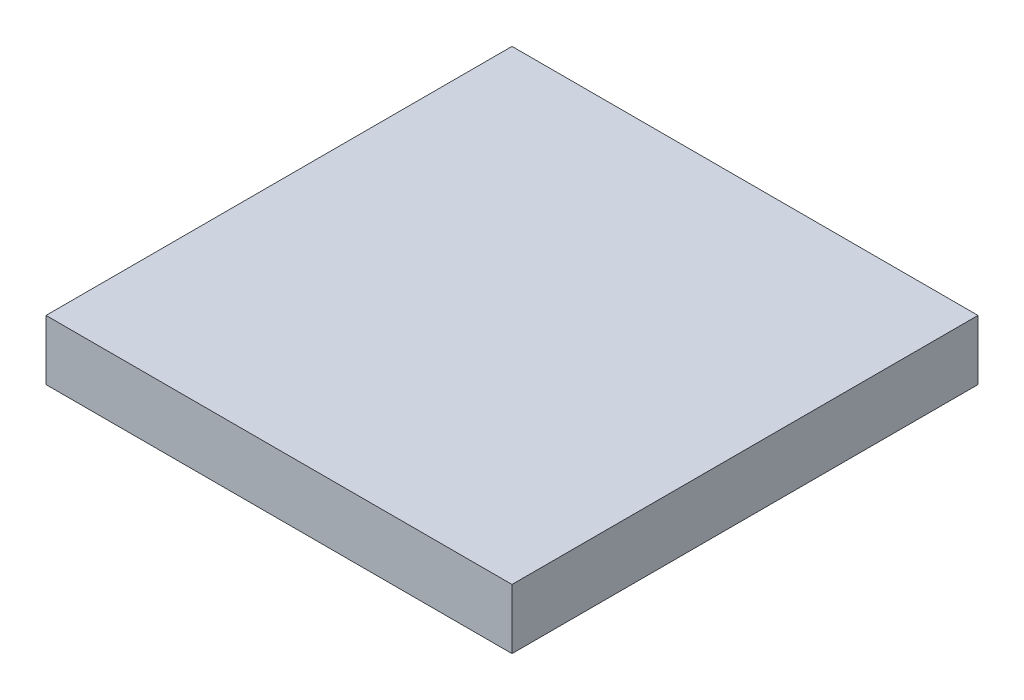
ISO-10303-21;
HEADER;
FILE_DESCRIPTION(('STEP AP214'),'2;1');
FILE_NAME('part.step','',(''),(''),'','','');
FILE_SCHEMA(('AUTOMOTIVE_DESIGN { 1 0 10303 214 1 1 1 1 }'));
ENDSEC;
DATA;
#1=APPLICATION_CONTEXT('core data for automotive mechanical design processes');
#2=APPLICATION_PROTOCOL_DEFINITION('international standard','automotive_design',2000,#1);
#3=PRODUCT_CONTEXT('',#1,'mechanical');
#4=PRODUCT('Part','Part','',(#3));
#5=PRODUCT_RELATED_PRODUCT_CATEGORY('part','',(#4));
#6=PRODUCT_DEFINITION_FORMATION('','',#4);
#7=PRODUCT_DEFINITION_CONTEXT('part definition',#1,'design');
#8=PRODUCT_DEFINITION('design','',#6,#7);
#9=PRODUCT_DEFINITION_SHAPE('','',#8);
#10=(LENGTH_UNIT() NAMED_UNIT(*) SI_UNIT(.MILLI.,.METRE.));
#11=(NAMED_UNIT(*) PLANE_ANGLE_UNIT() SI_UNIT($,.RADIAN.));
#12=(NAMED_UNIT(*) SI_UNIT($,.STERADIAN.) SOLID_ANGLE_UNIT());
#13=UNCERTAINTY_MEASURE_WITH_UNIT(LENGTH_MEASURE(1.E-05),#10,'distance_accuracy_value','');
#14=(GEOMETRIC_REPRESENTATION_CONTEXT(3) GLOBAL_UNCERTAINTY_ASSIGNED_CONTEXT((#13)) GLOBAL_UNIT_ASSIGNED_CONTEXT((#10,
#11,#12)) REPRESENTATION_CONTEXT('',''));
#15=CARTESIAN_POINT('',(0.,0.,0.));
#16=DIRECTION('',(0.,0.,1.));
#17=DIRECTION('',(1.,0.,0.));
#18=AXIS2_PLACEMENT_3D('',#15,#16,#17);
#19=CARTESIAN_POINT('',(3.5,0.9,-3.5));
#20=DIRECTION('',(-1.,0.,0.));
#21=DIRECTION('',(0.,0.,1.));
#22=AXIS2_PLACEMENT_3D('',#19,#20,#21);
#23=PLANE('',#22);
#24=DIRECTION('',(0.,0.,-1.));
#25=VECTOR('',#24,1.);
#26=CARTESIAN_POINT('',(3.5,0.,-3.5));
#27=LINE('',#26,#25);
#28=CARTESIAN_POINT('',(3.5,0.,3.5));
#29=VERTEX_POINT('',#28);
#30=CARTESIAN_POINT('',(3.5,0.,-3.5));
#31=VERTEX_POINT('',#30);
#32=EDGE_CURVE('E98',#29,#31,#27,.T.);
#33=ORIENTED_EDGE('',*,*,#32,.T.);
#34=DIRECTION('',(0.,-1.,0.));
#35=VECTOR('',#34,1.);
#36=CARTESIAN_POINT('',(3.5,0.9,-3.5));
#37=LINE('',#36,#35);
#38=CARTESIAN_POINT('',(3.5,0.9,-3.5));
#39=VERTEX_POINT('',#38);
#40=EDGE_CURVE('E11',#39,#31,#37,.T.);
#41=ORIENTED_EDGE('',*,*,#40,.F.);
#42=DIRECTION('',(0.,0.,-1.));
#43=VECTOR('',#42,1.);
#44=CARTESIAN_POINT('',(3.5,0.9,-3.5));
#45=LINE('',#44,#43);
#46=CARTESIAN_POINT('',(3.5,0.9,3.5));
#47=VERTEX_POINT('',#46);
#48=EDGE_CURVE('E86',#47,#39,#45,.T.);
#49=ORIENTED_EDGE('',*,*,#48,.F.);
#50=DIRECTION('',(0.,-1.,0.));
#51=VECTOR('',#50,1.);
#52=CARTESIAN_POINT('',(3.5,0.9,3.5));
#53=LINE('',#52,#51);
#54=EDGE_CURVE('E94',#47,#29,#53,.T.);
#55=ORIENTED_EDGE('',*,*,#54,.T.);
#56=EDGE_LOOP('',(#33,#41,#49,#55));
#57=FACE_BOUND('',#56,.T.);
#58=ADVANCED_FACE('F35',(#57),#23,.F.);
#59=CARTESIAN_POINT('',(-3.5,0.9,-3.5));
#60=DIRECTION('',(0.,0.,1.));
#61=DIRECTION('',(1.,0.,0.));
#62=AXIS2_PLACEMENT_3D('',#59,#60,#61);
#63=PLANE('',#62);
#64=DIRECTION('',(-1.,0.,0.));
#65=VECTOR('',#64,1.);
#66=CARTESIAN_POINT('',(-3.5,0.,-3.5));
#67=LINE('',#66,#65);
#68=CARTESIAN_POINT('',(-3.5,0.,-3.5));
#69=VERTEX_POINT('',#68);
#70=EDGE_CURVE('E90',#31,#69,#67,.T.);
#71=ORIENTED_EDGE('',*,*,#70,.T.);
#72=DIRECTION('',(0.,-1.,0.));
#73=VECTOR('',#72,1.);
#74=CARTESIAN_POINT('',(-3.5,0.9,-3.5));
#75=LINE('',#74,#73);
#76=CARTESIAN_POINT('',(-3.5,0.9,-3.5));
#77=VERTEX_POINT('',#76);
#78=EDGE_CURVE('E43',#77,#69,#75,.T.);
#79=ORIENTED_EDGE('',*,*,#78,.F.);
#80=DIRECTION('',(-1.,0.,0.));
#81=VECTOR('',#80,1.);
#82=CARTESIAN_POINT('',(-3.5,0.9,-3.5));
#83=LINE('',#82,#81);
#84=EDGE_CURVE('E81',#39,#77,#83,.T.);
#85=ORIENTED_EDGE('',*,*,#84,.F.);
#86=ORIENTED_EDGE('',*,*,#40,.T.);
#87=EDGE_LOOP('',(#71,#79,#85,#86));
#88=FACE_BOUND('',#87,.T.);
#89=ADVANCED_FACE('F89',(#88),#63,.F.);
#90=CARTESIAN_POINT('',(-3.5,0.9,-3.5));
#91=DIRECTION('',(1.,0.,0.));
#92=DIRECTION('',(0.,0.,-1.));
#93=AXIS2_PLACEMENT_3D('',#90,#91,#92);
#94=PLANE('',#93);
#95=DIRECTION('',(0.,0.,1.));
#96=VECTOR('',#95,1.);
#97=CARTESIAN_POINT('',(-3.5,0.,-3.5));
#98=LINE('',#97,#96);
#99=CARTESIAN_POINT('',(-3.5,0.,3.5));
#100=VERTEX_POINT('',#99);
#101=EDGE_CURVE('E68',#69,#100,#98,.T.);
#102=ORIENTED_EDGE('',*,*,#101,.T.);
#103=DIRECTION('',(0.,-1.,0.));
#104=VECTOR('',#103,1.);
#105=CARTESIAN_POINT('',(-3.5,0.9,3.5));
#106=LINE('',#105,#104);
#107=CARTESIAN_POINT('',(-3.5,0.9,3.5));
#108=VERTEX_POINT('',#107);
#109=EDGE_CURVE('E91',#108,#100,#106,.T.);
#110=ORIENTED_EDGE('',*,*,#109,.F.);
#111=DIRECTION('',(0.,0.,1.));
#112=VECTOR('',#111,1.);
#113=CARTESIAN_POINT('',(-3.5,0.9,-3.5));
#114=LINE('',#113,#112);
#115=EDGE_CURVE('E84',#77,#108,#114,.T.);
#116=ORIENTED_EDGE('',*,*,#115,.F.);
#117=ORIENTED_EDGE('',*,*,#78,.T.);
#118=EDGE_LOOP('',(#102,#110,#116,#117));
#119=FACE_BOUND('',#118,.T.);
#120=ADVANCED_FACE('F92',(#119),#94,.F.);
#121=CARTESIAN_POINT('',(-3.5,0.9,3.5));
#122=DIRECTION('',(0.,0.,-1.));
#123=DIRECTION('',(-1.,0.,0.));
#124=AXIS2_PLACEMENT_3D('',#121,#122,#123);
#125=PLANE('',#124);
#126=DIRECTION('',(1.,0.,0.));
#127=VECTOR('',#126,1.);
#128=CARTESIAN_POINT('',(-3.5,0.,3.5));
#129=LINE('',#128,#127);
#130=EDGE_CURVE('E74',#100,#29,#129,.T.);
#131=ORIENTED_EDGE('',*,*,#130,.T.);
#132=ORIENTED_EDGE('',*,*,#54,.F.);
#133=DIRECTION('',(1.,0.,0.));
#134=VECTOR('',#133,1.);
#135=CARTESIAN_POINT('',(-3.5,0.9,3.5));
#136=LINE('',#135,#134);
#137=EDGE_CURVE('E51',#108,#47,#136,.T.);
#138=ORIENTED_EDGE('',*,*,#137,.F.);
#139=ORIENTED_EDGE('',*,*,#109,.T.);
#140=EDGE_LOOP('',(#131,#132,#138,#139));
#141=FACE_BOUND('',#140,.T.);
#142=ADVANCED_FACE('F105',(#141),#125,.F.);
#143=CARTESIAN_POINT('',(0.,0.9,0.));
#144=DIRECTION('',(0.,1.,0.));
#145=DIRECTION('',(0.,0.,1.));
#146=AXIS2_PLACEMENT_3D('',#143,#144,#145);
#147=PLANE('',#146);
#148=ORIENTED_EDGE('',*,*,#48,.T.);
#149=ORIENTED_EDGE('',*,*,#84,.T.);
#150=ORIENTED_EDGE('',*,*,#115,.T.);
#151=ORIENTED_EDGE('',*,*,#137,.T.);
#152=EDGE_LOOP('',(#148,#149,#150,#151));
#153=FACE_BOUND('',#152,.T.);
#154=ADVANCED_FACE('F82',(#153),#147,.T.);
#155=CARTESIAN_POINT('',(0.,0.,0.));
#156=DIRECTION('',(0.,1.,0.));
#157=DIRECTION('',(0.,0.,1.));
#158=AXIS2_PLACEMENT_3D('',#155,#156,#157);
#159=PLANE('',#158);
#160=ORIENTED_EDGE('',*,*,#32,.F.);
#161=ORIENTED_EDGE('',*,*,#130,.F.);
#162=ORIENTED_EDGE('',*,*,#101,.F.);
#163=ORIENTED_EDGE('',*,*,#70,.F.);
#164=EDGE_LOOP('',(#160,#161,#162,#163));
#165=FACE_BOUND('',#164,.T.);
#166=ADVANCED_FACE('F108',(#165),#159,.F.);
#167=CLOSED_SHELL('',(#58,#89,#120,#142,#154,#166));
#168=MANIFOLD_SOLID_BREP('B2',#167);
#169=ADVANCED_BREP_SHAPE_REPRESENTATION('',(#18,#168),#14);
#170=SHAPE_DEFINITION_REPRESENTATION(#9,#169);
ENDSEC;
END-ISO-10303-21;
